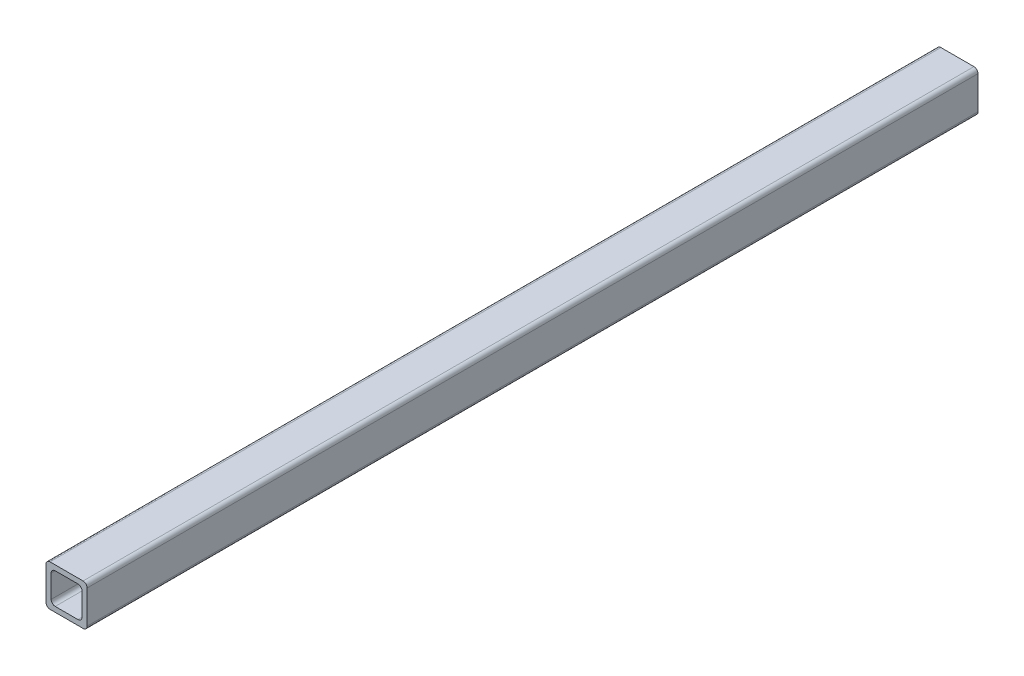
ISO-10303-21;
HEADER;
FILE_DESCRIPTION(('STEP AP214'),'2;1');
FILE_NAME('part.step','',(''),(''),'','','');
FILE_SCHEMA(('AUTOMOTIVE_DESIGN { 1 0 10303 214 1 1 1 1 }'));
ENDSEC;
DATA;
#1=APPLICATION_CONTEXT('core data for automotive mechanical design processes');
#2=APPLICATION_PROTOCOL_DEFINITION('international standard','automotive_design',2000,#1);
#3=PRODUCT_CONTEXT('',#1,'mechanical');
#4=PRODUCT('Part','Part','',(#3));
#5=PRODUCT_RELATED_PRODUCT_CATEGORY('part','',(#4));
#6=PRODUCT_DEFINITION_FORMATION('','',#4);
#7=PRODUCT_DEFINITION_CONTEXT('part definition',#1,'design');
#8=PRODUCT_DEFINITION('design','',#6,#7);
#9=PRODUCT_DEFINITION_SHAPE('','',#8);
#10=(LENGTH_UNIT() NAMED_UNIT(*) SI_UNIT(.MILLI.,.METRE.));
#11=(NAMED_UNIT(*) PLANE_ANGLE_UNIT() SI_UNIT($,.RADIAN.));
#12=(NAMED_UNIT(*) SI_UNIT($,.STERADIAN.) SOLID_ANGLE_UNIT());
#13=UNCERTAINTY_MEASURE_WITH_UNIT(LENGTH_MEASURE(1.E-05),#10,'distance_accuracy_value','');
#14=(GEOMETRIC_REPRESENTATION_CONTEXT(3) GLOBAL_UNCERTAINTY_ASSIGNED_CONTEXT((#13)) GLOBAL_UNIT_ASSIGNED_CONTEXT((#10,
#11,#12)) REPRESENTATION_CONTEXT('',''));
#15=CARTESIAN_POINT('',(0.,0.,0.));
#16=DIRECTION('',(0.,0.,1.));
#17=DIRECTION('',(1.,0.,0.));
#18=AXIS2_PLACEMENT_3D('',#15,#16,#17);
#19=CARTESIAN_POINT('',(10.2,-10.2,550.));
#20=DIRECTION('',(0.,0.,-1.));
#21=DIRECTION('',(-1.,0.,0.));
#22=AXIS2_PLACEMENT_3D('',#19,#20,#21);
#23=PLANE('',#22);
#24=CARTESIAN_POINT('',(10.2,-10.2,550.));
#25=DIRECTION('',(0.,0.,1.));
#26=DIRECTION('',(-1.,0.,0.));
#27=AXIS2_PLACEMENT_3D('',#24,#25,#26);
#28=CIRCLE('',#27,2.5);
#29=CARTESIAN_POINT('',(10.2,-12.7,550.));
#30=VERTEX_POINT('',#29);
#31=CARTESIAN_POINT('',(12.7,-10.2,550.));
#32=VERTEX_POINT('',#31);
#33=EDGE_CURVE('E215',#30,#32,#28,.T.);
#34=ORIENTED_EDGE('',*,*,#33,.T.);
#35=DIRECTION('',(0.,1.,0.));
#36=VECTOR('',#35,1.);
#37=CARTESIAN_POINT('',(12.7,-10.2,550.));
#38=LINE('',#37,#36);
#39=CARTESIAN_POINT('',(12.7,10.2,550.));
#40=VERTEX_POINT('',#39);
#41=EDGE_CURVE('E218',#32,#40,#38,.T.);
#42=ORIENTED_EDGE('',*,*,#41,.T.);
#43=CARTESIAN_POINT('',(10.2,10.2,550.));
#44=DIRECTION('',(0.,0.,1.));
#45=DIRECTION('',(1.,0.,0.));
#46=AXIS2_PLACEMENT_3D('',#43,#44,#45);
#47=CIRCLE('',#46,2.5);
#48=CARTESIAN_POINT('',(10.2,12.7,550.));
#49=VERTEX_POINT('',#48);
#50=EDGE_CURVE('E221',#40,#49,#47,.T.);
#51=ORIENTED_EDGE('',*,*,#50,.T.);
#52=DIRECTION('',(-1.,0.,0.));
#53=VECTOR('',#52,1.);
#54=CARTESIAN_POINT('',(-10.2,12.7,550.));
#55=LINE('',#54,#53);
#56=CARTESIAN_POINT('',(-10.2,12.7,550.));
#57=VERTEX_POINT('',#56);
#58=EDGE_CURVE('E223',#49,#57,#55,.T.);
#59=ORIENTED_EDGE('',*,*,#58,.T.);
#60=CARTESIAN_POINT('',(-10.2,10.2,550.));
#61=DIRECTION('',(0.,0.,1.));
#62=DIRECTION('',(1.,0.,0.));
#63=AXIS2_PLACEMENT_3D('',#60,#61,#62);
#64=CIRCLE('',#63,2.5);
#65=CARTESIAN_POINT('',(-12.7,10.2,550.));
#66=VERTEX_POINT('',#65);
#67=EDGE_CURVE('E225',#57,#66,#64,.T.);
#68=ORIENTED_EDGE('',*,*,#67,.T.);
#69=DIRECTION('',(0.,-1.,0.));
#70=VECTOR('',#69,1.);
#71=CARTESIAN_POINT('',(-12.7,-10.2,550.));
#72=LINE('',#71,#70);
#73=CARTESIAN_POINT('',(-12.7,-10.2,550.));
#74=VERTEX_POINT('',#73);
#75=EDGE_CURVE('E227',#66,#74,#72,.T.);
#76=ORIENTED_EDGE('',*,*,#75,.T.);
#77=CARTESIAN_POINT('',(-10.2,-10.2,550.));
#78=DIRECTION('',(0.,0.,1.));
#79=DIRECTION('',(-1.,0.,0.));
#80=AXIS2_PLACEMENT_3D('',#77,#78,#79);
#81=CIRCLE('',#80,2.5);
#82=CARTESIAN_POINT('',(-10.2,-12.7,550.));
#83=VERTEX_POINT('',#82);
#84=EDGE_CURVE('E229',#74,#83,#81,.T.);
#85=ORIENTED_EDGE('',*,*,#84,.T.);
#86=DIRECTION('',(1.,0.,0.));
#87=VECTOR('',#86,1.);
#88=CARTESIAN_POINT('',(-10.2,-12.7,550.));
#89=LINE('',#88,#87);
#90=EDGE_CURVE('E231',#83,#30,#89,.T.);
#91=ORIENTED_EDGE('',*,*,#90,.T.);
#92=EDGE_LOOP('',(#34,#42,#51,#59,#68,#76,#85,#91));
#93=FACE_BOUND('',#92,.T.);
#94=CARTESIAN_POINT('',(-7.02500000000001,-7.02499999999998,550.));
#95=DIRECTION('',(0.,0.,1.));
#96=DIRECTION('',(-1.,0.,0.));
#97=AXIS2_PLACEMENT_3D('',#94,#95,#96);
#98=CIRCLE('',#97,2.5);
#99=CARTESIAN_POINT('',(-9.52500000000001,-7.02499999999998,550.));
#100=VERTEX_POINT('',#99);
#101=CARTESIAN_POINT('',(-7.02500000000001,-9.52499999999998,550.));
#102=VERTEX_POINT('',#101);
#103=EDGE_CURVE('E150',#100,#102,#98,.T.);
#104=ORIENTED_EDGE('',*,*,#103,.F.);
#105=DIRECTION('',(0.,-1.,0.));
#106=VECTOR('',#105,1.);
#107=CARTESIAN_POINT('',(-9.52500000000001,-7.02499999999998,550.));
#108=LINE('',#107,#106);
#109=CARTESIAN_POINT('',(-9.52500000000001,7.025,550.));
#110=VERTEX_POINT('',#109);
#111=EDGE_CURVE('E183',#110,#100,#108,.T.);
#112=ORIENTED_EDGE('',*,*,#111,.F.);
#113=CARTESIAN_POINT('',(-7.025,7.025,550.));
#114=DIRECTION('',(0.,0.,1.));
#115=DIRECTION('',(-1.,0.,0.));
#116=AXIS2_PLACEMENT_3D('',#113,#114,#115);
#117=CIRCLE('',#116,2.5);
#118=CARTESIAN_POINT('',(-7.025,9.52500000000001,550.));
#119=VERTEX_POINT('',#118);
#120=EDGE_CURVE('E181',#119,#110,#117,.T.);
#121=ORIENTED_EDGE('',*,*,#120,.F.);
#122=DIRECTION('',(-1.,0.,0.));
#123=VECTOR('',#122,1.);
#124=CARTESIAN_POINT('',(-7.025,9.52500000000001,550.));
#125=LINE('',#124,#123);
#126=CARTESIAN_POINT('',(7.02499999999999,9.52500000000001,550.));
#127=VERTEX_POINT('',#126);
#128=EDGE_CURVE('E179',#127,#119,#125,.T.);
#129=ORIENTED_EDGE('',*,*,#128,.F.);
#130=CARTESIAN_POINT('',(7.02499999999999,7.025,550.));
#131=DIRECTION('',(0.,0.,1.));
#132=DIRECTION('',(1.,0.,0.));
#133=AXIS2_PLACEMENT_3D('',#130,#131,#132);
#134=CIRCLE('',#133,2.5);
#135=CARTESIAN_POINT('',(9.52499999999999,7.025,550.));
#136=VERTEX_POINT('',#135);
#137=EDGE_CURVE('E177',#136,#127,#134,.T.);
#138=ORIENTED_EDGE('',*,*,#137,.F.);
#139=DIRECTION('',(0.,1.,0.));
#140=VECTOR('',#139,1.);
#141=CARTESIAN_POINT('',(9.52499999999999,-7.02499999999998,550.));
#142=LINE('',#141,#140);
#143=CARTESIAN_POINT('',(9.52499999999999,-7.02499999999998,550.));
#144=VERTEX_POINT('',#143);
#145=EDGE_CURVE('E173',#144,#136,#142,.T.);
#146=ORIENTED_EDGE('',*,*,#145,.F.);
#147=CARTESIAN_POINT('',(7.02499999999999,-7.02499999999998,550.));
#148=DIRECTION('',(0.,0.,1.));
#149=DIRECTION('',(1.,0.,0.));
#150=AXIS2_PLACEMENT_3D('',#147,#148,#149);
#151=CIRCLE('',#150,2.5);
#152=CARTESIAN_POINT('',(7.02499999999999,-9.52499999999998,550.));
#153=VERTEX_POINT('',#152);
#154=EDGE_CURVE('E171',#153,#144,#151,.T.);
#155=ORIENTED_EDGE('',*,*,#154,.F.);
#156=DIRECTION('',(1.,0.,0.));
#157=VECTOR('',#156,1.);
#158=CARTESIAN_POINT('',(-7.02500000000001,-9.52499999999998,550.));
#159=LINE('',#158,#157);
#160=EDGE_CURVE('E158',#102,#153,#159,.T.);
#161=ORIENTED_EDGE('',*,*,#160,.F.);
#162=EDGE_LOOP('',(#104,#112,#121,#129,#138,#146,#155,#161));
#163=FACE_BOUND('',#162,.T.);
#164=ADVANCED_FACE('F37',(#93,#163),#23,.F.);
#165=CARTESIAN_POINT('',(10.2,-10.2,0.));
#166=DIRECTION('',(0.,0.,-1.));
#167=DIRECTION('',(-1.,0.,0.));
#168=AXIS2_PLACEMENT_3D('',#165,#166,#167);
#169=PLANE('',#168);
#170=CARTESIAN_POINT('',(10.2,-10.2,0.));
#171=DIRECTION('',(0.,0.,1.));
#172=DIRECTION('',(-1.,0.,0.));
#173=AXIS2_PLACEMENT_3D('',#170,#171,#172);
#174=CIRCLE('',#173,2.5);
#175=CARTESIAN_POINT('',(10.2,-12.7,0.));
#176=VERTEX_POINT('',#175);
#177=CARTESIAN_POINT('',(12.7,-10.2,0.));
#178=VERTEX_POINT('',#177);
#179=EDGE_CURVE('E166',#176,#178,#174,.T.);
#180=ORIENTED_EDGE('',*,*,#179,.F.);
#181=DIRECTION('',(1.,0.,0.));
#182=VECTOR('',#181,1.);
#183=CARTESIAN_POINT('',(-10.2,-12.7,0.));
#184=LINE('',#183,#182);
#185=CARTESIAN_POINT('',(-10.2,-12.7,0.));
#186=VERTEX_POINT('',#185);
#187=EDGE_CURVE('E219',#186,#176,#184,.T.);
#188=ORIENTED_EDGE('',*,*,#187,.F.);
#189=CARTESIAN_POINT('',(-10.2,-10.2,0.));
#190=DIRECTION('',(0.,0.,1.));
#191=DIRECTION('',(-1.,0.,0.));
#192=AXIS2_PLACEMENT_3D('',#189,#190,#191);
#193=CIRCLE('',#192,2.5);
#194=CARTESIAN_POINT('',(-12.7,-10.2,0.));
#195=VERTEX_POINT('',#194);
#196=EDGE_CURVE('E246',#195,#186,#193,.T.);
#197=ORIENTED_EDGE('',*,*,#196,.F.);
#198=DIRECTION('',(0.,-1.,0.));
#199=VECTOR('',#198,1.);
#200=CARTESIAN_POINT('',(-12.7,-10.2,0.));
#201=LINE('',#200,#199);
#202=CARTESIAN_POINT('',(-12.7,10.2,0.));
#203=VERTEX_POINT('',#202);
#204=EDGE_CURVE('E244',#203,#195,#201,.T.);
#205=ORIENTED_EDGE('',*,*,#204,.F.);
#206=CARTESIAN_POINT('',(-10.2,10.2,0.));
#207=DIRECTION('',(0.,0.,1.));
#208=DIRECTION('',(1.,0.,0.));
#209=AXIS2_PLACEMENT_3D('',#206,#207,#208);
#210=CIRCLE('',#209,2.5);
#211=CARTESIAN_POINT('',(-10.2,12.7,0.));
#212=VERTEX_POINT('',#211);
#213=EDGE_CURVE('E242',#212,#203,#210,.T.);
#214=ORIENTED_EDGE('',*,*,#213,.F.);
#215=DIRECTION('',(-1.,0.,0.));
#216=VECTOR('',#215,1.);
#217=CARTESIAN_POINT('',(-10.2,12.7,0.));
#218=LINE('',#217,#216);
#219=CARTESIAN_POINT('',(10.2,12.7,0.));
#220=VERTEX_POINT('',#219);
#221=EDGE_CURVE('E240',#220,#212,#218,.T.);
#222=ORIENTED_EDGE('',*,*,#221,.F.);
#223=CARTESIAN_POINT('',(10.2,10.2,0.));
#224=DIRECTION('',(0.,0.,1.));
#225=DIRECTION('',(1.,0.,0.));
#226=AXIS2_PLACEMENT_3D('',#223,#224,#225);
#227=CIRCLE('',#226,2.5);
#228=CARTESIAN_POINT('',(12.7,10.2,0.));
#229=VERTEX_POINT('',#228);
#230=EDGE_CURVE('E238',#229,#220,#227,.T.);
#231=ORIENTED_EDGE('',*,*,#230,.F.);
#232=DIRECTION('',(0.,1.,0.));
#233=VECTOR('',#232,1.);
#234=CARTESIAN_POINT('',(12.7,-10.2,0.));
#235=LINE('',#234,#233);
#236=EDGE_CURVE('E236',#178,#229,#235,.T.);
#237=ORIENTED_EDGE('',*,*,#236,.F.);
#238=EDGE_LOOP('',(#180,#188,#197,#205,#214,#222,#231,#237));
#239=FACE_BOUND('',#238,.T.);
#240=DIRECTION('',(0.,-1.,0.));
#241=VECTOR('',#240,1.);
#242=CARTESIAN_POINT('',(-9.52500000000001,-7.02499999999998,0.));
#243=LINE('',#242,#241);
#244=CARTESIAN_POINT('',(-9.52500000000001,7.02500000000001,0.));
#245=VERTEX_POINT('',#244);
#246=CARTESIAN_POINT('',(-9.52500000000001,-7.02499999999998,0.));
#247=VERTEX_POINT('',#246);
#248=EDGE_CURVE('E159',#245,#247,#243,.T.);
#249=ORIENTED_EDGE('',*,*,#248,.T.);
#250=CARTESIAN_POINT('',(-7.02500000000001,-7.02499999999998,0.));
#251=DIRECTION('',(0.,0.,1.));
#252=DIRECTION('',(-1.,0.,0.));
#253=AXIS2_PLACEMENT_3D('',#250,#251,#252);
#254=CIRCLE('',#253,2.5);
#255=CARTESIAN_POINT('',(-7.02500000000001,-9.52499999999998,0.));
#256=VERTEX_POINT('',#255);
#257=EDGE_CURVE('E60',#247,#256,#254,.T.);
#258=ORIENTED_EDGE('',*,*,#257,.T.);
#259=DIRECTION('',(1.,0.,0.));
#260=VECTOR('',#259,1.);
#261=CARTESIAN_POINT('',(-7.02500000000001,-9.52499999999998,0.));
#262=LINE('',#261,#260);
#263=CARTESIAN_POINT('',(7.02499999999999,-9.52499999999998,0.));
#264=VERTEX_POINT('',#263);
#265=EDGE_CURVE('E165',#256,#264,#262,.T.);
#266=ORIENTED_EDGE('',*,*,#265,.T.);
#267=CARTESIAN_POINT('',(7.02499999999999,-7.02499999999998,0.));
#268=DIRECTION('',(0.,0.,1.));
#269=DIRECTION('',(1.,0.,0.));
#270=AXIS2_PLACEMENT_3D('',#267,#268,#269);
#271=CIRCLE('',#270,2.5);
#272=CARTESIAN_POINT('',(9.52499999999999,-7.02499999999998,0.));
#273=VERTEX_POINT('',#272);
#274=EDGE_CURVE('E187',#264,#273,#271,.T.);
#275=ORIENTED_EDGE('',*,*,#274,.T.);
#276=DIRECTION('',(0.,1.,0.));
#277=VECTOR('',#276,1.);
#278=CARTESIAN_POINT('',(9.52499999999999,-7.02499999999998,0.));
#279=LINE('',#278,#277);
#280=CARTESIAN_POINT('',(9.52499999999999,7.025,0.));
#281=VERTEX_POINT('',#280);
#282=EDGE_CURVE('E190',#273,#281,#279,.T.);
#283=ORIENTED_EDGE('',*,*,#282,.T.);
#284=CARTESIAN_POINT('',(7.02499999999999,7.025,0.));
#285=DIRECTION('',(0.,0.,1.));
#286=DIRECTION('',(1.,0.,0.));
#287=AXIS2_PLACEMENT_3D('',#284,#285,#286);
#288=CIRCLE('',#287,2.5);
#289=CARTESIAN_POINT('',(7.02499999999999,9.52500000000001,0.));
#290=VERTEX_POINT('',#289);
#291=EDGE_CURVE('E193',#281,#290,#288,.T.);
#292=ORIENTED_EDGE('',*,*,#291,.T.);
#293=DIRECTION('',(-1.,0.,0.));
#294=VECTOR('',#293,1.);
#295=CARTESIAN_POINT('',(-7.025,9.52500000000001,0.));
#296=LINE('',#295,#294);
#297=CARTESIAN_POINT('',(-7.025,9.52500000000001,0.));
#298=VERTEX_POINT('',#297);
#299=EDGE_CURVE('E196',#290,#298,#296,.T.);
#300=ORIENTED_EDGE('',*,*,#299,.T.);
#301=CARTESIAN_POINT('',(-7.025,7.025,0.));
#302=DIRECTION('',(0.,0.,1.));
#303=DIRECTION('',(-1.,0.,0.));
#304=AXIS2_PLACEMENT_3D('',#301,#302,#303);
#305=CIRCLE('',#304,2.5);
#306=EDGE_CURVE('E199',#298,#245,#305,.T.);
#307=ORIENTED_EDGE('',*,*,#306,.T.);
#308=EDGE_LOOP('',(#249,#258,#266,#275,#283,#292,#300,#307));
#309=FACE_BOUND('',#308,.T.);
#310=ADVANCED_FACE('F276',(#239,#309),#169,.T.);
#311=CARTESIAN_POINT('',(10.2,-10.2,550.));
#312=DIRECTION('',(0.,0.,-1.));
#313=DIRECTION('',(-1.,0.,0.));
#314=AXIS2_PLACEMENT_3D('',#311,#312,#313);
#315=CYLINDRICAL_SURFACE('',#314,2.5);
#316=ORIENTED_EDGE('',*,*,#179,.T.);
#317=DIRECTION('',(0.,0.,-1.));
#318=VECTOR('',#317,1.);
#319=CARTESIAN_POINT('',(12.7,-10.2,550.));
#320=LINE('',#319,#318);
#321=EDGE_CURVE('E11',#32,#178,#320,.T.);
#322=ORIENTED_EDGE('',*,*,#321,.F.);
#323=ORIENTED_EDGE('',*,*,#33,.F.);
#324=DIRECTION('',(0.,0.,-1.));
#325=VECTOR('',#324,1.);
#326=CARTESIAN_POINT('',(10.2,-12.7,550.));
#327=LINE('',#326,#325);
#328=EDGE_CURVE('E233',#30,#176,#327,.T.);
#329=ORIENTED_EDGE('',*,*,#328,.T.);
#330=EDGE_LOOP('',(#316,#322,#323,#329));
#331=FACE_BOUND('',#330,.T.);
#332=ADVANCED_FACE('F39',(#331),#315,.T.);
#333=CARTESIAN_POINT('',(12.7,-10.2,550.));
#334=DIRECTION('',(-1.,0.,0.));
#335=DIRECTION('',(0.,-1.,0.));
#336=AXIS2_PLACEMENT_3D('',#333,#334,#335);
#337=PLANE('',#336);
#338=ORIENTED_EDGE('',*,*,#236,.T.);
#339=DIRECTION('',(0.,0.,-1.));
#340=VECTOR('',#339,1.);
#341=CARTESIAN_POINT('',(12.7,10.2,550.));
#342=LINE('',#341,#340);
#343=EDGE_CURVE('E45',#40,#229,#342,.T.);
#344=ORIENTED_EDGE('',*,*,#343,.F.);
#345=ORIENTED_EDGE('',*,*,#41,.F.);
#346=ORIENTED_EDGE('',*,*,#321,.T.);
#347=EDGE_LOOP('',(#338,#344,#345,#346));
#348=FACE_BOUND('',#347,.T.);
#349=ADVANCED_FACE('F293',(#348),#337,.F.);
#350=CARTESIAN_POINT('',(10.2,10.2,550.));
#351=DIRECTION('',(0.,0.,-1.));
#352=DIRECTION('',(-1.,0.,0.));
#353=AXIS2_PLACEMENT_3D('',#350,#351,#352);
#354=CYLINDRICAL_SURFACE('',#353,2.5);
#355=ORIENTED_EDGE('',*,*,#230,.T.);
#356=DIRECTION('',(0.,0.,-1.));
#357=VECTOR('',#356,1.);
#358=CARTESIAN_POINT('',(10.2,12.7,550.));
#359=LINE('',#358,#357);
#360=EDGE_CURVE('E263',#49,#220,#359,.T.);
#361=ORIENTED_EDGE('',*,*,#360,.F.);
#362=ORIENTED_EDGE('',*,*,#50,.F.);
#363=ORIENTED_EDGE('',*,*,#343,.T.);
#364=EDGE_LOOP('',(#355,#361,#362,#363));
#365=FACE_BOUND('',#364,.T.);
#366=ADVANCED_FACE('F270',(#365),#354,.T.);
#367=CARTESIAN_POINT('',(-10.2,12.7,550.));
#368=DIRECTION('',(0.,-1.,0.));
#369=DIRECTION('',(1.,0.,0.));
#370=AXIS2_PLACEMENT_3D('',#367,#368,#369);
#371=PLANE('',#370);
#372=ORIENTED_EDGE('',*,*,#221,.T.);
#373=DIRECTION('',(0.,0.,-1.));
#374=VECTOR('',#373,1.);
#375=CARTESIAN_POINT('',(-10.2,12.7,550.));
#376=LINE('',#375,#374);
#377=EDGE_CURVE('E260',#57,#212,#376,.T.);
#378=ORIENTED_EDGE('',*,*,#377,.F.);
#379=ORIENTED_EDGE('',*,*,#58,.F.);
#380=ORIENTED_EDGE('',*,*,#360,.T.);
#381=EDGE_LOOP('',(#372,#378,#379,#380));
#382=FACE_BOUND('',#381,.T.);
#383=ADVANCED_FACE('F282',(#382),#371,.F.);
#384=CARTESIAN_POINT('',(-10.2,10.2,550.));
#385=DIRECTION('',(0.,0.,-1.));
#386=DIRECTION('',(-1.,0.,0.));
#387=AXIS2_PLACEMENT_3D('',#384,#385,#386);
#388=CYLINDRICAL_SURFACE('',#387,2.5);
#389=ORIENTED_EDGE('',*,*,#213,.T.);
#390=DIRECTION('',(0.,0.,-1.));
#391=VECTOR('',#390,1.);
#392=CARTESIAN_POINT('',(-12.7,10.2,550.));
#393=LINE('',#392,#391);
#394=EDGE_CURVE('E257',#66,#203,#393,.T.);
#395=ORIENTED_EDGE('',*,*,#394,.F.);
#396=ORIENTED_EDGE('',*,*,#67,.F.);
#397=ORIENTED_EDGE('',*,*,#377,.T.);
#398=EDGE_LOOP('',(#389,#395,#396,#397));
#399=FACE_BOUND('',#398,.T.);
#400=ADVANCED_FACE('F286',(#399),#388,.T.);
#401=CARTESIAN_POINT('',(-12.7,-10.2,550.));
#402=DIRECTION('',(1.,0.,0.));
#403=DIRECTION('',(0.,0.,-1.));
#404=AXIS2_PLACEMENT_3D('',#401,#402,#403);
#405=PLANE('',#404);
#406=ORIENTED_EDGE('',*,*,#204,.T.);
#407=DIRECTION('',(0.,0.,-1.));
#408=VECTOR('',#407,1.);
#409=CARTESIAN_POINT('',(-12.7,-10.2,550.));
#410=LINE('',#409,#408);
#411=EDGE_CURVE('E254',#74,#195,#410,.T.);
#412=ORIENTED_EDGE('',*,*,#411,.F.);
#413=ORIENTED_EDGE('',*,*,#75,.F.);
#414=ORIENTED_EDGE('',*,*,#394,.T.);
#415=EDGE_LOOP('',(#406,#412,#413,#414));
#416=FACE_BOUND('',#415,.T.);
#417=ADVANCED_FACE('F306',(#416),#405,.F.);
#418=CARTESIAN_POINT('',(-10.2,-10.2,550.));
#419=DIRECTION('',(0.,0.,-1.));
#420=DIRECTION('',(-1.,0.,0.));
#421=AXIS2_PLACEMENT_3D('',#418,#419,#420);
#422=CYLINDRICAL_SURFACE('',#421,2.5);
#423=ORIENTED_EDGE('',*,*,#196,.T.);
#424=DIRECTION('',(0.,0.,-1.));
#425=VECTOR('',#424,1.);
#426=CARTESIAN_POINT('',(-10.2,-12.7,550.));
#427=LINE('',#426,#425);
#428=EDGE_CURVE('E251',#83,#186,#427,.T.);
#429=ORIENTED_EDGE('',*,*,#428,.F.);
#430=ORIENTED_EDGE('',*,*,#84,.F.);
#431=ORIENTED_EDGE('',*,*,#411,.T.);
#432=EDGE_LOOP('',(#423,#429,#430,#431));
#433=FACE_BOUND('',#432,.T.);
#434=ADVANCED_FACE('F304',(#433),#422,.T.);
#435=CARTESIAN_POINT('',(-10.2,-12.7,550.));
#436=DIRECTION('',(0.,1.,0.));
#437=DIRECTION('',(0.,0.,1.));
#438=AXIS2_PLACEMENT_3D('',#435,#436,#437);
#439=PLANE('',#438);
#440=ORIENTED_EDGE('',*,*,#187,.T.);
#441=ORIENTED_EDGE('',*,*,#328,.F.);
#442=ORIENTED_EDGE('',*,*,#90,.F.);
#443=ORIENTED_EDGE('',*,*,#428,.T.);
#444=EDGE_LOOP('',(#440,#441,#442,#443));
#445=FACE_BOUND('',#444,.T.);
#446=ADVANCED_FACE('F299',(#445),#439,.F.);
#447=CARTESIAN_POINT('',(-7.02500000000001,-7.02499999999998,550.));
#448=DIRECTION('',(0.,0.,-1.));
#449=DIRECTION('',(-1.,0.,0.));
#450=AXIS2_PLACEMENT_3D('',#447,#448,#449);
#451=CYLINDRICAL_SURFACE('',#450,2.5);
#452=ORIENTED_EDGE('',*,*,#257,.F.);
#453=DIRECTION('',(0.,0.,-1.));
#454=VECTOR('',#453,1.);
#455=CARTESIAN_POINT('',(-9.52500000000001,-7.02499999999998,550.));
#456=LINE('',#455,#454);
#457=EDGE_CURVE('E154',#100,#247,#456,.T.);
#458=ORIENTED_EDGE('',*,*,#457,.F.);
#459=ORIENTED_EDGE('',*,*,#103,.T.);
#460=DIRECTION('',(0.,0.,-1.));
#461=VECTOR('',#460,1.);
#462=CARTESIAN_POINT('',(-7.02500000000001,-9.52499999999998,550.));
#463=LINE('',#462,#461);
#464=EDGE_CURVE('E153',#102,#256,#463,.T.);
#465=ORIENTED_EDGE('',*,*,#464,.T.);
#466=EDGE_LOOP('',(#452,#458,#459,#465));
#467=FACE_BOUND('',#466,.T.);
#468=ADVANCED_FACE('F152',(#467),#451,.F.);
#469=CARTESIAN_POINT('',(-7.02500000000001,-9.52499999999998,550.));
#470=DIRECTION('',(0.,1.,0.));
#471=DIRECTION('',(0.,0.,1.));
#472=AXIS2_PLACEMENT_3D('',#469,#470,#471);
#473=PLANE('',#472);
#474=ORIENTED_EDGE('',*,*,#265,.F.);
#475=ORIENTED_EDGE('',*,*,#464,.F.);
#476=ORIENTED_EDGE('',*,*,#160,.T.);
#477=DIRECTION('',(0.,0.,-1.));
#478=VECTOR('',#477,1.);
#479=CARTESIAN_POINT('',(7.02499999999999,-9.52499999999998,550.));
#480=LINE('',#479,#478);
#481=EDGE_CURVE('E167',#153,#264,#480,.T.);
#482=ORIENTED_EDGE('',*,*,#481,.T.);
#483=EDGE_LOOP('',(#474,#475,#476,#482));
#484=FACE_BOUND('',#483,.T.);
#485=ADVANCED_FACE('F162',(#484),#473,.T.);
#486=CARTESIAN_POINT('',(7.02499999999999,-7.02499999999998,550.));
#487=DIRECTION('',(0.,0.,-1.));
#488=DIRECTION('',(-1.,0.,0.));
#489=AXIS2_PLACEMENT_3D('',#486,#487,#488);
#490=CYLINDRICAL_SURFACE('',#489,2.5);
#491=ORIENTED_EDGE('',*,*,#274,.F.);
#492=ORIENTED_EDGE('',*,*,#481,.F.);
#493=ORIENTED_EDGE('',*,*,#154,.T.);
#494=DIRECTION('',(0.,0.,-1.));
#495=VECTOR('',#494,1.);
#496=CARTESIAN_POINT('',(9.52499999999999,-7.02499999999998,550.));
#497=LINE('',#496,#495);
#498=EDGE_CURVE('E212',#144,#273,#497,.T.);
#499=ORIENTED_EDGE('',*,*,#498,.T.);
#500=EDGE_LOOP('',(#491,#492,#493,#499));
#501=FACE_BOUND('',#500,.T.);
#502=ADVANCED_FACE('F331',(#501),#490,.F.);
#503=CARTESIAN_POINT('',(9.52499999999999,-7.02499999999998,550.));
#504=DIRECTION('',(-1.,0.,0.));
#505=DIRECTION('',(0.,-1.,0.));
#506=AXIS2_PLACEMENT_3D('',#503,#504,#505);
#507=PLANE('',#506);
#508=ORIENTED_EDGE('',*,*,#282,.F.);
#509=ORIENTED_EDGE('',*,*,#498,.F.);
#510=ORIENTED_EDGE('',*,*,#145,.T.);
#511=DIRECTION('',(0.,0.,-1.));
#512=VECTOR('',#511,1.);
#513=CARTESIAN_POINT('',(9.52499999999999,7.025,550.));
#514=LINE('',#513,#512);
#515=EDGE_CURVE('E210',#136,#281,#514,.T.);
#516=ORIENTED_EDGE('',*,*,#515,.T.);
#517=EDGE_LOOP('',(#508,#509,#510,#516));
#518=FACE_BOUND('',#517,.T.);
#519=ADVANCED_FACE('F335',(#518),#507,.T.);
#520=CARTESIAN_POINT('',(7.02499999999999,7.025,550.));
#521=DIRECTION('',(0.,0.,-1.));
#522=DIRECTION('',(-1.,0.,0.));
#523=AXIS2_PLACEMENT_3D('',#520,#521,#522);
#524=CYLINDRICAL_SURFACE('',#523,2.5);
#525=ORIENTED_EDGE('',*,*,#291,.F.);
#526=ORIENTED_EDGE('',*,*,#515,.F.);
#527=ORIENTED_EDGE('',*,*,#137,.T.);
#528=DIRECTION('',(0.,0.,-1.));
#529=VECTOR('',#528,1.);
#530=CARTESIAN_POINT('',(7.02499999999999,9.52500000000001,550.));
#531=LINE('',#530,#529);
#532=EDGE_CURVE('E208',#127,#290,#531,.T.);
#533=ORIENTED_EDGE('',*,*,#532,.T.);
#534=EDGE_LOOP('',(#525,#526,#527,#533));
#535=FACE_BOUND('',#534,.T.);
#536=ADVANCED_FACE('F341',(#535),#524,.F.);
#537=CARTESIAN_POINT('',(-7.025,9.52500000000001,550.));
#538=DIRECTION('',(0.,-1.,0.));
#539=DIRECTION('',(0.,0.,-1.));
#540=AXIS2_PLACEMENT_3D('',#537,#538,#539);
#541=PLANE('',#540);
#542=ORIENTED_EDGE('',*,*,#299,.F.);
#543=ORIENTED_EDGE('',*,*,#532,.F.);
#544=ORIENTED_EDGE('',*,*,#128,.T.);
#545=DIRECTION('',(0.,0.,-1.));
#546=VECTOR('',#545,1.);
#547=CARTESIAN_POINT('',(-7.025,9.52500000000001,550.));
#548=LINE('',#547,#546);
#549=EDGE_CURVE('E206',#119,#298,#548,.T.);
#550=ORIENTED_EDGE('',*,*,#549,.T.);
#551=EDGE_LOOP('',(#542,#543,#544,#550));
#552=FACE_BOUND('',#551,.T.);
#553=ADVANCED_FACE('F345',(#552),#541,.T.);
#554=CARTESIAN_POINT('',(-7.025,7.025,550.));
#555=DIRECTION('',(0.,0.,-1.));
#556=DIRECTION('',(-1.,0.,0.));
#557=AXIS2_PLACEMENT_3D('',#554,#555,#556);
#558=CYLINDRICAL_SURFACE('',#557,2.5);
#559=ORIENTED_EDGE('',*,*,#306,.F.);
#560=ORIENTED_EDGE('',*,*,#549,.F.);
#561=ORIENTED_EDGE('',*,*,#120,.T.);
#562=DIRECTION('',(0.,0.,-1.));
#563=VECTOR('',#562,1.);
#564=CARTESIAN_POINT('',(-9.52500000000001,7.02500000000001,550.));
#565=LINE('',#564,#563);
#566=EDGE_CURVE('E52',#110,#245,#565,.T.);
#567=ORIENTED_EDGE('',*,*,#566,.T.);
#568=EDGE_LOOP('',(#559,#560,#561,#567));
#569=FACE_BOUND('',#568,.T.);
#570=ADVANCED_FACE('F349',(#569),#558,.F.);
#571=CARTESIAN_POINT('',(-9.52500000000001,-7.02499999999998,550.));
#572=DIRECTION('',(1.,0.,0.));
#573=DIRECTION('',(0.,0.,-1.));
#574=AXIS2_PLACEMENT_3D('',#571,#572,#573);
#575=PLANE('',#574);
#576=ORIENTED_EDGE('',*,*,#248,.F.);
#577=ORIENTED_EDGE('',*,*,#566,.F.);
#578=ORIENTED_EDGE('',*,*,#111,.T.);
#579=ORIENTED_EDGE('',*,*,#457,.T.);
#580=EDGE_LOOP('',(#576,#577,#578,#579));
#581=FACE_BOUND('',#580,.T.);
#582=ADVANCED_FACE('F353',(#581),#575,.T.);
#583=CLOSED_SHELL('',(#164,#310,#332,#349,#366,#383,#400,#417,#434,#446,#468,#485,#502,#519,
#536,#553,#570,#582));
#584=MANIFOLD_SOLID_BREP('B2',#583);
#585=ADVANCED_BREP_SHAPE_REPRESENTATION('',(#18,#584),#14);
#586=SHAPE_DEFINITION_REPRESENTATION(#9,#585);
ENDSEC;
END-ISO-10303-21;
